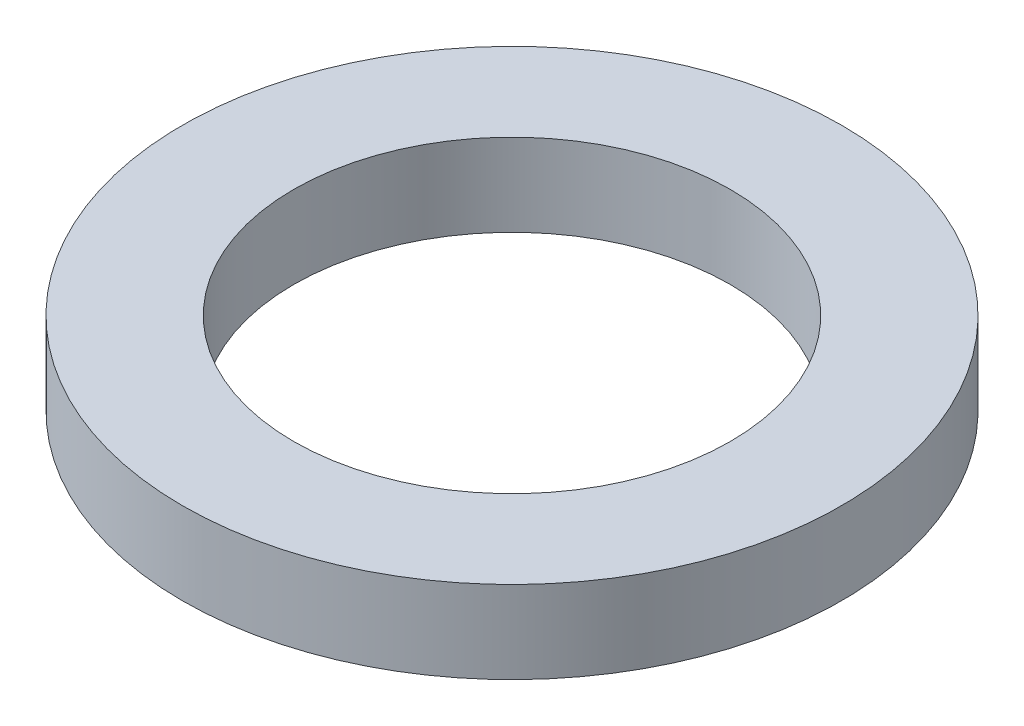
ISO-10303-21;
HEADER;
FILE_DESCRIPTION(('STEP AP214'),'2;1');
FILE_NAME('part.step','',(''),(''),'','','');
FILE_SCHEMA(('AUTOMOTIVE_DESIGN { 1 0 10303 214 1 1 1 1 }'));
ENDSEC;
DATA;
#1=APPLICATION_CONTEXT('core data for automotive mechanical design processes');
#2=APPLICATION_PROTOCOL_DEFINITION('international standard','automotive_design',2000,#1);
#3=PRODUCT_CONTEXT('',#1,'mechanical');
#4=PRODUCT('Part','Part','',(#3));
#5=PRODUCT_RELATED_PRODUCT_CATEGORY('part','',(#4));
#6=PRODUCT_DEFINITION_FORMATION('','',#4);
#7=PRODUCT_DEFINITION_CONTEXT('part definition',#1,'design');
#8=PRODUCT_DEFINITION('design','',#6,#7);
#9=PRODUCT_DEFINITION_SHAPE('','',#8);
#10=(LENGTH_UNIT() NAMED_UNIT(*) SI_UNIT(.MILLI.,.METRE.));
#11=(NAMED_UNIT(*) PLANE_ANGLE_UNIT() SI_UNIT($,.RADIAN.));
#12=(NAMED_UNIT(*) SI_UNIT($,.STERADIAN.) SOLID_ANGLE_UNIT());
#13=UNCERTAINTY_MEASURE_WITH_UNIT(LENGTH_MEASURE(1.E-05),#10,'distance_accuracy_value','');
#14=(GEOMETRIC_REPRESENTATION_CONTEXT(3) GLOBAL_UNCERTAINTY_ASSIGNED_CONTEXT((#13)) GLOBAL_UNIT_ASSIGNED_CONTEXT((#10,
#11,#12)) REPRESENTATION_CONTEXT('',''));
#15=CARTESIAN_POINT('',(0.,0.,0.));
#16=DIRECTION('',(0.,0.,1.));
#17=DIRECTION('',(1.,0.,0.));
#18=AXIS2_PLACEMENT_3D('',#15,#16,#17);
#19=CARTESIAN_POINT('',(0.,1.,0.));
#20=DIRECTION('',(0.,1.,0.));
#21=DIRECTION('',(0.,0.,1.));
#22=AXIS2_PLACEMENT_3D('',#19,#20,#21);
#23=PLANE('',#22);
#24=CARTESIAN_POINT('',(0.,1.,0.));
#25=DIRECTION('',(0.,1.,0.));
#26=DIRECTION('',(0.,0.,1.));
#27=AXIS2_PLACEMENT_3D('',#24,#25,#26);
#28=CIRCLE('',#27,4.);
#29=CARTESIAN_POINT('',(0.,1.,4.));
#30=VERTEX_POINT('',#29);
#31=EDGE_CURVE('E10',#30,#30,#28,.T.);
#32=ORIENTED_EDGE('',*,*,#31,.T.);
#33=EDGE_LOOP('',(#32));
#34=FACE_BOUND('',#33,.T.);
#35=CARTESIAN_POINT('',(0.,1.,0.));
#36=DIRECTION('',(0.,1.,0.));
#37=DIRECTION('',(0.,0.,1.));
#38=AXIS2_PLACEMENT_3D('',#35,#36,#37);
#39=CIRCLE('',#38,2.65);
#40=CARTESIAN_POINT('',(0.,1.,2.65));
#41=VERTEX_POINT('',#40);
#42=EDGE_CURVE('E41',#41,#41,#39,.T.);
#43=ORIENTED_EDGE('',*,*,#42,.F.);
#44=EDGE_LOOP('',(#43));
#45=FACE_BOUND('',#44,.T.);
#46=ADVANCED_FACE('F30',(#34,#45),#23,.T.);
#47=CARTESIAN_POINT('',(0.,0.,0.));
#48=DIRECTION('',(0.,1.,0.));
#49=DIRECTION('',(0.,0.,1.));
#50=AXIS2_PLACEMENT_3D('',#47,#48,#49);
#51=PLANE('',#50);
#52=CARTESIAN_POINT('',(0.,0.,0.));
#53=DIRECTION('',(0.,1.,0.));
#54=DIRECTION('',(0.,0.,1.));
#55=AXIS2_PLACEMENT_3D('',#52,#53,#54);
#56=CIRCLE('',#55,4.);
#57=CARTESIAN_POINT('',(0.,0.,4.));
#58=VERTEX_POINT('',#57);
#59=EDGE_CURVE('E34',#58,#58,#56,.T.);
#60=ORIENTED_EDGE('',*,*,#59,.F.);
#61=EDGE_LOOP('',(#60));
#62=FACE_BOUND('',#61,.T.);
#63=CARTESIAN_POINT('',(0.,0.,0.));
#64=DIRECTION('',(0.,1.,0.));
#65=DIRECTION('',(0.,0.,1.));
#66=AXIS2_PLACEMENT_3D('',#63,#64,#65);
#67=CIRCLE('',#66,2.65);
#68=CARTESIAN_POINT('',(0.,0.,2.65));
#69=VERTEX_POINT('',#68);
#70=EDGE_CURVE('E43',#69,#69,#67,.T.);
#71=ORIENTED_EDGE('',*,*,#70,.T.);
#72=EDGE_LOOP('',(#71));
#73=FACE_BOUND('',#72,.T.);
#74=ADVANCED_FACE('F53',(#62,#73),#51,.F.);
#75=CARTESIAN_POINT('',(0.,1.,0.));
#76=DIRECTION('',(0.,-1.,0.));
#77=DIRECTION('',(0.,0.,-1.));
#78=AXIS2_PLACEMENT_3D('',#75,#76,#77);
#79=CYLINDRICAL_SURFACE('',#78,4.);
#80=ORIENTED_EDGE('',*,*,#31,.F.);
#81=EDGE_LOOP('',(#80));
#82=FACE_BOUND('',#81,.T.);
#83=ORIENTED_EDGE('',*,*,#59,.T.);
#84=EDGE_LOOP('',(#83));
#85=FACE_BOUND('',#84,.T.);
#86=ADVANCED_FACE('F32',(#82,#85),#79,.T.);
#87=CARTESIAN_POINT('',(0.,1.,0.));
#88=DIRECTION('',(0.,-1.,0.));
#89=DIRECTION('',(0.,0.,-1.));
#90=AXIS2_PLACEMENT_3D('',#87,#88,#89);
#91=CYLINDRICAL_SURFACE('',#90,2.65);
#92=ORIENTED_EDGE('',*,*,#42,.T.);
#93=EDGE_LOOP('',(#92));
#94=FACE_BOUND('',#93,.T.);
#95=ORIENTED_EDGE('',*,*,#70,.F.);
#96=EDGE_LOOP('',(#95));
#97=FACE_BOUND('',#96,.T.);
#98=ADVANCED_FACE('F49',(#94,#97),#91,.F.);
#99=CLOSED_SHELL('',(#46,#74,#86,#98));
#100=MANIFOLD_SOLID_BREP('B2',#99);
#101=ADVANCED_BREP_SHAPE_REPRESENTATION('',(#18,#100),#14);
#102=SHAPE_DEFINITION_REPRESENTATION(#9,#101);
ENDSEC;
END-ISO-10303-21;
